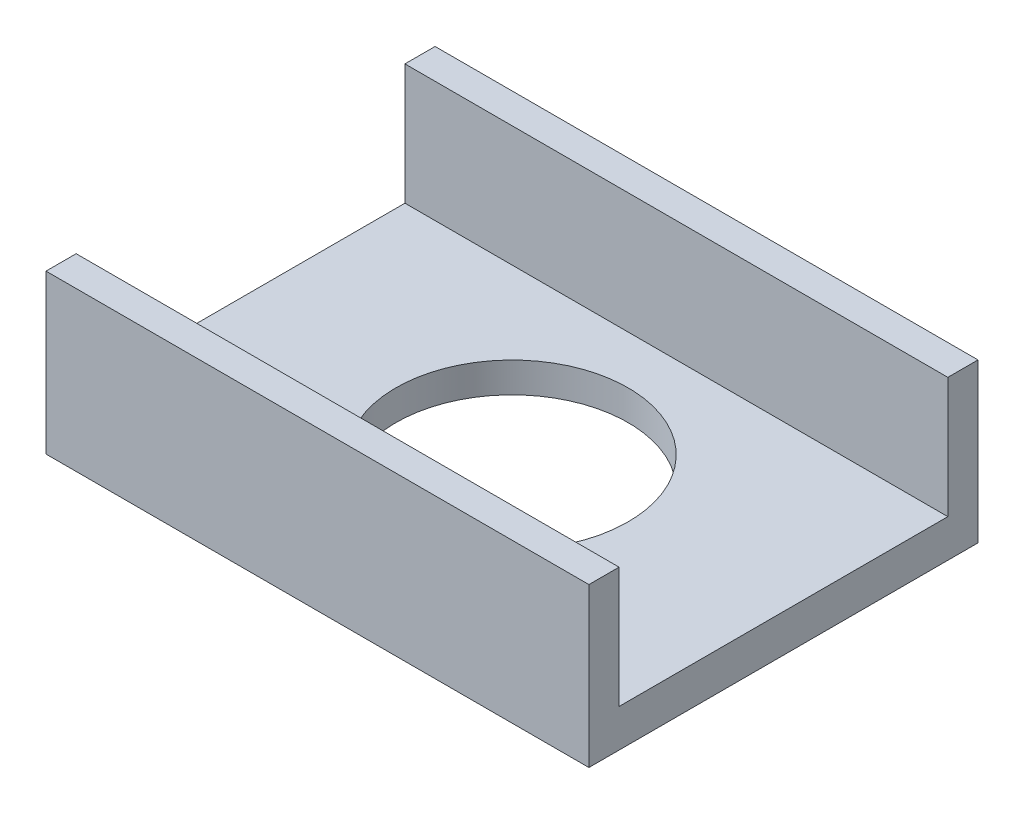
ISO-10303-21;
HEADER;
FILE_DESCRIPTION(('STEP AP214'),'2;1');
FILE_NAME('part.step','',(''),(''),'','','');
FILE_SCHEMA(('AUTOMOTIVE_DESIGN { 1 0 10303 214 1 1 1 1 }'));
ENDSEC;
DATA;
#1=APPLICATION_CONTEXT('core data for automotive mechanical design processes');
#2=APPLICATION_PROTOCOL_DEFINITION('international standard','automotive_design',2000,#1);
#3=PRODUCT_CONTEXT('',#1,'mechanical');
#4=PRODUCT('Part','Part','',(#3));
#5=PRODUCT_RELATED_PRODUCT_CATEGORY('part','',(#4));
#6=PRODUCT_DEFINITION_FORMATION('','',#4);
#7=PRODUCT_DEFINITION_CONTEXT('part definition',#1,'design');
#8=PRODUCT_DEFINITION('design','',#6,#7);
#9=PRODUCT_DEFINITION_SHAPE('','',#8);
#10=(LENGTH_UNIT() NAMED_UNIT(*) SI_UNIT(.MILLI.,.METRE.));
#11=(NAMED_UNIT(*) PLANE_ANGLE_UNIT() SI_UNIT($,.RADIAN.));
#12=(NAMED_UNIT(*) SI_UNIT($,.STERADIAN.) SOLID_ANGLE_UNIT());
#13=UNCERTAINTY_MEASURE_WITH_UNIT(LENGTH_MEASURE(1.E-05),#10,'distance_accuracy_value','');
#14=(GEOMETRIC_REPRESENTATION_CONTEXT(3) GLOBAL_UNCERTAINTY_ASSIGNED_CONTEXT((#13)) GLOBAL_UNIT_ASSIGNED_CONTEXT((#10,
#11,#12)) REPRESENTATION_CONTEXT('',''));
#15=CARTESIAN_POINT('',(0.,0.,0.));
#16=DIRECTION('',(0.,0.,1.));
#17=DIRECTION('',(1.,0.,0.));
#18=AXIS2_PLACEMENT_3D('',#15,#16,#17);
#19=CARTESIAN_POINT('',(0.,5.,0.));
#20=DIRECTION('',(0.,1.,0.));
#21=DIRECTION('',(0.,0.,1.));
#22=AXIS2_PLACEMENT_3D('',#19,#20,#21);
#23=PLANE('',#22);
#24=CARTESIAN_POINT('',(4.44089209850063E-13,5.,2.22044604925031E-13));
#25=DIRECTION('',(0.,1.,0.));
#26=DIRECTION('',(0.,0.,1.));
#27=AXIS2_PLACEMENT_3D('',#24,#25,#26);
#28=CIRCLE('',#27,19.25);
#29=CARTESIAN_POINT('',(4.44089209850063E-13,5.,19.2500000000002));
#30=VERTEX_POINT('',#29);
#31=EDGE_CURVE('E159',#30,#30,#28,.T.);
#32=ORIENTED_EDGE('',*,*,#31,.F.);
#33=EDGE_LOOP('',(#32));
#34=FACE_BOUND('',#33,.T.);
#35=DIRECTION('',(1.,0.,0.));
#36=VECTOR('',#35,1.);
#37=CARTESIAN_POINT('',(0.,5.,27.25));
#38=LINE('',#37,#36);
#39=CARTESIAN_POINT('',(-45.,5.,27.25));
#40=VERTEX_POINT('',#39);
#41=CARTESIAN_POINT('',(45.,5.,27.25));
#42=VERTEX_POINT('',#41);
#43=EDGE_CURVE('E58',#40,#42,#38,.T.);
#44=ORIENTED_EDGE('',*,*,#43,.T.);
#45=DIRECTION('',(0.,0.,1.));
#46=VECTOR('',#45,1.);
#47=CARTESIAN_POINT('',(45.,5.,0.));
#48=LINE('',#47,#46);
#49=CARTESIAN_POINT('',(45.,5.,-27.25));
#50=VERTEX_POINT('',#49);
#51=EDGE_CURVE('E225',#50,#42,#48,.T.);
#52=ORIENTED_EDGE('',*,*,#51,.F.);
#53=DIRECTION('',(-1.,0.,0.));
#54=VECTOR('',#53,1.);
#55=CARTESIAN_POINT('',(0.,5.,-27.25));
#56=LINE('',#55,#54);
#57=CARTESIAN_POINT('',(-45.,5.,-27.25));
#58=VERTEX_POINT('',#57);
#59=EDGE_CURVE('E139',#50,#58,#56,.T.);
#60=ORIENTED_EDGE('',*,*,#59,.T.);
#61=DIRECTION('',(0.,0.,1.));
#62=VECTOR('',#61,1.);
#63=CARTESIAN_POINT('',(-45.,5.,0.));
#64=LINE('',#63,#62);
#65=EDGE_CURVE('E63',#58,#40,#64,.T.);
#66=ORIENTED_EDGE('',*,*,#65,.T.);
#67=EDGE_LOOP('',(#44,#52,#60,#66));
#68=FACE_BOUND('',#67,.T.);
#69=ADVANCED_FACE('F41',(#34,#68),#23,.T.);
#70=CARTESIAN_POINT('',(0.,-1.27,0.));
#71=DIRECTION('',(0.,1.,0.));
#72=DIRECTION('',(0.,0.,1.));
#73=AXIS2_PLACEMENT_3D('',#70,#71,#72);
#74=PLANE('',#73);
#75=DIRECTION('',(0.,0.,1.));
#76=VECTOR('',#75,1.);
#77=CARTESIAN_POINT('',(45.,-1.27,0.));
#78=LINE('',#77,#76);
#79=CARTESIAN_POINT('',(45.,-1.27,-32.25));
#80=VERTEX_POINT('',#79);
#81=CARTESIAN_POINT('',(45.,-1.27,32.25));
#82=VERTEX_POINT('',#81);
#83=EDGE_CURVE('E246',#80,#82,#78,.T.);
#84=ORIENTED_EDGE('',*,*,#83,.T.);
#85=DIRECTION('',(1.,0.,0.));
#86=VECTOR('',#85,1.);
#87=CARTESIAN_POINT('',(0.,-1.27,32.25));
#88=LINE('',#87,#86);
#89=CARTESIAN_POINT('',(-45.,-1.27,32.25));
#90=VERTEX_POINT('',#89);
#91=EDGE_CURVE('E241',#90,#82,#88,.T.);
#92=ORIENTED_EDGE('',*,*,#91,.F.);
#93=DIRECTION('',(0.,0.,1.));
#94=VECTOR('',#93,1.);
#95=CARTESIAN_POINT('',(-45.,-1.27,0.));
#96=LINE('',#95,#94);
#97=CARTESIAN_POINT('',(-45.,-1.27,-32.25));
#98=VERTEX_POINT('',#97);
#99=EDGE_CURVE('E255',#98,#90,#96,.T.);
#100=ORIENTED_EDGE('',*,*,#99,.F.);
#101=DIRECTION('',(1.,0.,0.));
#102=VECTOR('',#101,1.);
#103=CARTESIAN_POINT('',(0.,-1.27,-32.25));
#104=LINE('',#103,#102);
#105=EDGE_CURVE('E251',#98,#80,#104,.T.);
#106=ORIENTED_EDGE('',*,*,#105,.T.);
#107=EDGE_LOOP('',(#84,#92,#100,#106));
#108=FACE_BOUND('',#107,.T.);
#109=DIRECTION('',(0.,0.,1.));
#110=VECTOR('',#109,1.);
#111=CARTESIAN_POINT('',(40.,-1.27,0.));
#112=LINE('',#111,#110);
#113=CARTESIAN_POINT('',(40.,-1.27,-27.25));
#114=VERTEX_POINT('',#113);
#115=CARTESIAN_POINT('',(40.,-1.27,27.25));
#116=VERTEX_POINT('',#115);
#117=EDGE_CURVE('E193',#114,#116,#112,.T.);
#118=ORIENTED_EDGE('',*,*,#117,.F.);
#119=DIRECTION('',(1.,0.,0.));
#120=VECTOR('',#119,1.);
#121=CARTESIAN_POINT('',(0.,-1.27,-27.25));
#122=LINE('',#121,#120);
#123=CARTESIAN_POINT('',(-40.,-1.27,-27.25));
#124=VERTEX_POINT('',#123);
#125=EDGE_CURVE('E196',#124,#114,#122,.T.);
#126=ORIENTED_EDGE('',*,*,#125,.F.);
#127=DIRECTION('',(0.,0.,1.));
#128=VECTOR('',#127,1.);
#129=CARTESIAN_POINT('',(-40.,-1.27,0.));
#130=LINE('',#129,#128);
#131=CARTESIAN_POINT('',(-40.,-1.27,27.25));
#132=VERTEX_POINT('',#131);
#133=EDGE_CURVE('E200',#124,#132,#130,.T.);
#134=ORIENTED_EDGE('',*,*,#133,.T.);
#135=DIRECTION('',(1.,0.,0.));
#136=VECTOR('',#135,1.);
#137=CARTESIAN_POINT('',(0.,-1.27,27.25));
#138=LINE('',#137,#136);
#139=EDGE_CURVE('E204',#132,#116,#138,.T.);
#140=ORIENTED_EDGE('',*,*,#139,.T.);
#141=EDGE_LOOP('',(#118,#126,#134,#140));
#142=FACE_BOUND('',#141,.T.);
#143=ADVANCED_FACE('F262',(#108,#142),#74,.F.);
#144=CARTESIAN_POINT('',(45.,-1.27,0.));
#145=DIRECTION('',(-1.,0.,0.));
#146=DIRECTION('',(0.,0.,1.));
#147=AXIS2_PLACEMENT_3D('',#144,#145,#146);
#148=PLANE('',#147);
#149=DIRECTION('',(0.,1.,0.));
#150=VECTOR('',#149,1.);
#151=CARTESIAN_POINT('',(45.,-1.27,-32.25));
#152=LINE('',#151,#150);
#153=CARTESIAN_POINT('',(45.,25.,-32.25));
#154=VERTEX_POINT('',#153);
#155=EDGE_CURVE('E237',#80,#154,#152,.T.);
#156=ORIENTED_EDGE('',*,*,#155,.T.);
#157=DIRECTION('',(0.,0.,-1.));
#158=VECTOR('',#157,1.);
#159=CARTESIAN_POINT('',(45.,25.,0.));
#160=LINE('',#159,#158);
#161=CARTESIAN_POINT('',(45.,25.,-27.25));
#162=VERTEX_POINT('',#161);
#163=EDGE_CURVE('E173',#162,#154,#160,.T.);
#164=ORIENTED_EDGE('',*,*,#163,.F.);
#165=DIRECTION('',(0.,-1.,0.));
#166=VECTOR('',#165,1.);
#167=CARTESIAN_POINT('',(45.,25.,-27.25));
#168=LINE('',#167,#166);
#169=EDGE_CURVE('E189',#162,#50,#168,.T.);
#170=ORIENTED_EDGE('',*,*,#169,.T.);
#171=ORIENTED_EDGE('',*,*,#51,.T.);
#172=DIRECTION('',(0.,-1.,0.));
#173=VECTOR('',#172,1.);
#174=CARTESIAN_POINT('',(45.,25.,27.25));
#175=LINE('',#174,#173);
#176=CARTESIAN_POINT('',(45.,25.,27.25));
#177=VERTEX_POINT('',#176);
#178=EDGE_CURVE('E140',#177,#42,#175,.T.);
#179=ORIENTED_EDGE('',*,*,#178,.F.);
#180=DIRECTION('',(0.,0.,-1.));
#181=VECTOR('',#180,1.);
#182=CARTESIAN_POINT('',(45.,25.,0.));
#183=LINE('',#182,#181);
#184=CARTESIAN_POINT('',(45.,25.,32.25));
#185=VERTEX_POINT('',#184);
#186=EDGE_CURVE('E154',#185,#177,#183,.T.);
#187=ORIENTED_EDGE('',*,*,#186,.F.);
#188=DIRECTION('',(0.,1.,0.));
#189=VECTOR('',#188,1.);
#190=CARTESIAN_POINT('',(45.,-1.27,32.25));
#191=LINE('',#190,#189);
#192=EDGE_CURVE('E11',#82,#185,#191,.T.);
#193=ORIENTED_EDGE('',*,*,#192,.F.);
#194=ORIENTED_EDGE('',*,*,#83,.F.);
#195=EDGE_LOOP('',(#156,#164,#170,#171,#179,#187,#193,#194));
#196=FACE_BOUND('',#195,.T.);
#197=ADVANCED_FACE('F272',(#196),#148,.F.);
#198=CARTESIAN_POINT('',(0.,-1.27,32.25));
#199=DIRECTION('',(0.,0.,1.));
#200=DIRECTION('',(1.,0.,0.));
#201=AXIS2_PLACEMENT_3D('',#198,#199,#200);
#202=PLANE('',#201);
#203=ORIENTED_EDGE('',*,*,#192,.T.);
#204=DIRECTION('',(1.,0.,0.));
#205=VECTOR('',#204,1.);
#206=CARTESIAN_POINT('',(0.,25.,32.25));
#207=LINE('',#206,#205);
#208=CARTESIAN_POINT('',(-45.,25.,32.25));
#209=VERTEX_POINT('',#208);
#210=EDGE_CURVE('E150',#209,#185,#207,.T.);
#211=ORIENTED_EDGE('',*,*,#210,.F.);
#212=DIRECTION('',(0.,1.,0.));
#213=VECTOR('',#212,1.);
#214=CARTESIAN_POINT('',(-45.,-1.27,32.25));
#215=LINE('',#214,#213);
#216=EDGE_CURVE('E50',#90,#209,#215,.T.);
#217=ORIENTED_EDGE('',*,*,#216,.F.);
#218=ORIENTED_EDGE('',*,*,#91,.T.);
#219=EDGE_LOOP('',(#203,#211,#217,#218));
#220=FACE_BOUND('',#219,.T.);
#221=ADVANCED_FACE('F274',(#220),#202,.T.);
#222=CARTESIAN_POINT('',(-45.,-1.27,0.));
#223=DIRECTION('',(-1.,0.,0.));
#224=DIRECTION('',(0.,0.,1.));
#225=AXIS2_PLACEMENT_3D('',#222,#223,#224);
#226=PLANE('',#225);
#227=ORIENTED_EDGE('',*,*,#65,.F.);
#228=DIRECTION('',(0.,-1.,0.));
#229=VECTOR('',#228,1.);
#230=CARTESIAN_POINT('',(-45.,25.,-27.25));
#231=LINE('',#230,#229);
#232=CARTESIAN_POINT('',(-45.,25.,-27.25));
#233=VERTEX_POINT('',#232);
#234=EDGE_CURVE('E184',#233,#58,#231,.T.);
#235=ORIENTED_EDGE('',*,*,#234,.F.);
#236=DIRECTION('',(0.,0.,1.));
#237=VECTOR('',#236,1.);
#238=CARTESIAN_POINT('',(-45.,25.,0.));
#239=LINE('',#238,#237);
#240=CARTESIAN_POINT('',(-45.,25.,-32.25));
#241=VERTEX_POINT('',#240);
#242=EDGE_CURVE('E181',#241,#233,#239,.T.);
#243=ORIENTED_EDGE('',*,*,#242,.F.);
#244=DIRECTION('',(0.,1.,0.));
#245=VECTOR('',#244,1.);
#246=CARTESIAN_POINT('',(-45.,-1.27,-32.25));
#247=LINE('',#246,#245);
#248=EDGE_CURVE('E240',#98,#241,#247,.T.);
#249=ORIENTED_EDGE('',*,*,#248,.F.);
#250=ORIENTED_EDGE('',*,*,#99,.T.);
#251=ORIENTED_EDGE('',*,*,#216,.T.);
#252=DIRECTION('',(0.,0.,1.));
#253=VECTOR('',#252,1.);
#254=CARTESIAN_POINT('',(-45.,25.,0.));
#255=LINE('',#254,#253);
#256=CARTESIAN_POINT('',(-45.,25.,27.25));
#257=VERTEX_POINT('',#256);
#258=EDGE_CURVE('E143',#257,#209,#255,.T.);
#259=ORIENTED_EDGE('',*,*,#258,.F.);
#260=DIRECTION('',(0.,-1.,0.));
#261=VECTOR('',#260,1.);
#262=CARTESIAN_POINT('',(-45.,25.,27.25));
#263=LINE('',#262,#261);
#264=EDGE_CURVE('E131',#257,#40,#263,.T.);
#265=ORIENTED_EDGE('',*,*,#264,.T.);
#266=EDGE_LOOP('',(#227,#235,#243,#249,#250,#251,#259,#265));
#267=FACE_BOUND('',#266,.T.);
#268=ADVANCED_FACE('F144',(#267),#226,.T.);
#269=CARTESIAN_POINT('',(0.,-1.27,-32.25));
#270=DIRECTION('',(0.,0.,1.));
#271=DIRECTION('',(1.,0.,0.));
#272=AXIS2_PLACEMENT_3D('',#269,#270,#271);
#273=PLANE('',#272);
#274=ORIENTED_EDGE('',*,*,#248,.T.);
#275=DIRECTION('',(-1.,0.,0.));
#276=VECTOR('',#275,1.);
#277=CARTESIAN_POINT('',(0.,25.,-32.25));
#278=LINE('',#277,#276);
#279=EDGE_CURVE('E177',#154,#241,#278,.T.);
#280=ORIENTED_EDGE('',*,*,#279,.F.);
#281=ORIENTED_EDGE('',*,*,#155,.F.);
#282=ORIENTED_EDGE('',*,*,#105,.F.);
#283=EDGE_LOOP('',(#274,#280,#281,#282));
#284=FACE_BOUND('',#283,.T.);
#285=ADVANCED_FACE('F269',(#284),#273,.F.);
#286=CARTESIAN_POINT('',(40.,-1.27,0.));
#287=DIRECTION('',(-1.,0.,0.));
#288=DIRECTION('',(0.,0.,1.));
#289=AXIS2_PLACEMENT_3D('',#286,#287,#288);
#290=PLANE('',#289);
#291=DIRECTION('',(0.,0.,1.));
#292=VECTOR('',#291,1.);
#293=CARTESIAN_POINT('',(40.,0.,0.));
#294=LINE('',#293,#292);
#295=CARTESIAN_POINT('',(40.,0.,-27.25));
#296=VERTEX_POINT('',#295);
#297=CARTESIAN_POINT('',(40.,0.,27.25));
#298=VERTEX_POINT('',#297);
#299=EDGE_CURVE('E192',#296,#298,#294,.T.);
#300=ORIENTED_EDGE('',*,*,#299,.F.);
#301=DIRECTION('',(0.,1.,0.));
#302=VECTOR('',#301,1.);
#303=CARTESIAN_POINT('',(40.,-1.27,-27.25));
#304=LINE('',#303,#302);
#305=EDGE_CURVE('E208',#114,#296,#304,.T.);
#306=ORIENTED_EDGE('',*,*,#305,.F.);
#307=ORIENTED_EDGE('',*,*,#117,.T.);
#308=DIRECTION('',(0.,1.,0.));
#309=VECTOR('',#308,1.);
#310=CARTESIAN_POINT('',(40.,-1.27,27.25));
#311=LINE('',#310,#309);
#312=EDGE_CURVE('E222',#116,#298,#311,.T.);
#313=ORIENTED_EDGE('',*,*,#312,.T.);
#314=EDGE_LOOP('',(#300,#306,#307,#313));
#315=FACE_BOUND('',#314,.T.);
#316=ADVANCED_FACE('F321',(#315),#290,.T.);
#317=CARTESIAN_POINT('',(0.,-1.27,27.25));
#318=DIRECTION('',(0.,0.,1.));
#319=DIRECTION('',(1.,0.,0.));
#320=AXIS2_PLACEMENT_3D('',#317,#318,#319);
#321=PLANE('',#320);
#322=DIRECTION('',(1.,0.,0.));
#323=VECTOR('',#322,1.);
#324=CARTESIAN_POINT('',(0.,0.,27.25));
#325=LINE('',#324,#323);
#326=CARTESIAN_POINT('',(-40.,0.,27.25));
#327=VERTEX_POINT('',#326);
#328=EDGE_CURVE('E197',#327,#298,#325,.T.);
#329=ORIENTED_EDGE('',*,*,#328,.T.);
#330=ORIENTED_EDGE('',*,*,#312,.F.);
#331=ORIENTED_EDGE('',*,*,#139,.F.);
#332=DIRECTION('',(0.,1.,0.));
#333=VECTOR('',#332,1.);
#334=CARTESIAN_POINT('',(-40.,-1.27,27.25));
#335=LINE('',#334,#333);
#336=EDGE_CURVE('E226',#132,#327,#335,.T.);
#337=ORIENTED_EDGE('',*,*,#336,.T.);
#338=EDGE_LOOP('',(#329,#330,#331,#337));
#339=FACE_BOUND('',#338,.T.);
#340=ADVANCED_FACE('F317',(#339),#321,.F.);
#341=CARTESIAN_POINT('',(-40.,-1.27,0.));
#342=DIRECTION('',(-1.,0.,0.));
#343=DIRECTION('',(0.,0.,1.));
#344=AXIS2_PLACEMENT_3D('',#341,#342,#343);
#345=PLANE('',#344);
#346=DIRECTION('',(0.,0.,1.));
#347=VECTOR('',#346,1.);
#348=CARTESIAN_POINT('',(-40.,0.,0.));
#349=LINE('',#348,#347);
#350=CARTESIAN_POINT('',(-40.,0.,-27.25));
#351=VERTEX_POINT('',#350);
#352=EDGE_CURVE('E215',#351,#327,#349,.T.);
#353=ORIENTED_EDGE('',*,*,#352,.T.);
#354=ORIENTED_EDGE('',*,*,#336,.F.);
#355=ORIENTED_EDGE('',*,*,#133,.F.);
#356=DIRECTION('',(0.,1.,0.));
#357=VECTOR('',#356,1.);
#358=CARTESIAN_POINT('',(-40.,-1.27,-27.25));
#359=LINE('',#358,#357);
#360=EDGE_CURVE('E229',#124,#351,#359,.T.);
#361=ORIENTED_EDGE('',*,*,#360,.T.);
#362=EDGE_LOOP('',(#353,#354,#355,#361));
#363=FACE_BOUND('',#362,.T.);
#364=ADVANCED_FACE('F320',(#363),#345,.F.);
#365=CARTESIAN_POINT('',(0.,-1.27,-27.25));
#366=DIRECTION('',(0.,0.,1.));
#367=DIRECTION('',(1.,0.,0.));
#368=AXIS2_PLACEMENT_3D('',#365,#366,#367);
#369=PLANE('',#368);
#370=DIRECTION('',(1.,0.,0.));
#371=VECTOR('',#370,1.);
#372=CARTESIAN_POINT('',(0.,0.,-27.25));
#373=LINE('',#372,#371);
#374=EDGE_CURVE('E212',#351,#296,#373,.T.);
#375=ORIENTED_EDGE('',*,*,#374,.F.);
#376=ORIENTED_EDGE('',*,*,#360,.F.);
#377=ORIENTED_EDGE('',*,*,#125,.T.);
#378=ORIENTED_EDGE('',*,*,#305,.T.);
#379=EDGE_LOOP('',(#375,#376,#377,#378));
#380=FACE_BOUND('',#379,.T.);
#381=ADVANCED_FACE('F316',(#380),#369,.T.);
#382=CARTESIAN_POINT('',(0.,0.,0.));
#383=DIRECTION('',(0.,1.,0.));
#384=DIRECTION('',(0.,0.,1.));
#385=AXIS2_PLACEMENT_3D('',#382,#383,#384);
#386=PLANE('',#385);
#387=CARTESIAN_POINT('',(4.44089209850063E-13,0.,2.22044604925031E-13));
#388=DIRECTION('',(0.,1.,0.));
#389=DIRECTION('',(0.,0.,1.));
#390=AXIS2_PLACEMENT_3D('',#387,#388,#389);
#391=CIRCLE('',#390,19.25);
#392=CARTESIAN_POINT('',(4.44089209850063E-13,0.,19.2500000000002));
#393=VERTEX_POINT('',#392);
#394=EDGE_CURVE('E44',#393,#393,#391,.T.);
#395=ORIENTED_EDGE('',*,*,#394,.T.);
#396=EDGE_LOOP('',(#395));
#397=FACE_BOUND('',#396,.T.);
#398=ORIENTED_EDGE('',*,*,#299,.T.);
#399=ORIENTED_EDGE('',*,*,#328,.F.);
#400=ORIENTED_EDGE('',*,*,#352,.F.);
#401=ORIENTED_EDGE('',*,*,#374,.T.);
#402=EDGE_LOOP('',(#398,#399,#400,#401));
#403=FACE_BOUND('',#402,.T.);
#404=ADVANCED_FACE('F297',(#397,#403),#386,.F.);
#405=CARTESIAN_POINT('',(0.,25.,-27.25));
#406=DIRECTION('',(0.,0.,1.));
#407=DIRECTION('',(1.,0.,0.));
#408=AXIS2_PLACEMENT_3D('',#405,#406,#407);
#409=PLANE('',#408);
#410=ORIENTED_EDGE('',*,*,#59,.F.);
#411=ORIENTED_EDGE('',*,*,#169,.F.);
#412=DIRECTION('',(-1.,0.,0.));
#413=VECTOR('',#412,1.);
#414=CARTESIAN_POINT('',(0.,25.,-27.25));
#415=LINE('',#414,#413);
#416=EDGE_CURVE('E169',#162,#233,#415,.T.);
#417=ORIENTED_EDGE('',*,*,#416,.T.);
#418=ORIENTED_EDGE('',*,*,#234,.T.);
#419=EDGE_LOOP('',(#410,#411,#417,#418));
#420=FACE_BOUND('',#419,.T.);
#421=ADVANCED_FACE('F282',(#420),#409,.T.);
#422=CARTESIAN_POINT('',(0.,25.,0.));
#423=DIRECTION('',(0.,1.,0.));
#424=DIRECTION('',(0.,0.,1.));
#425=AXIS2_PLACEMENT_3D('',#422,#423,#424);
#426=PLANE('',#425);
#427=ORIENTED_EDGE('',*,*,#416,.F.);
#428=ORIENTED_EDGE('',*,*,#163,.T.);
#429=ORIENTED_EDGE('',*,*,#279,.T.);
#430=ORIENTED_EDGE('',*,*,#242,.T.);
#431=EDGE_LOOP('',(#427,#428,#429,#430));
#432=FACE_BOUND('',#431,.T.);
#433=ADVANCED_FACE('F279',(#432),#426,.T.);
#434=CARTESIAN_POINT('',(0.,25.,27.25));
#435=DIRECTION('',(0.,0.,-1.));
#436=DIRECTION('',(-1.,0.,0.));
#437=AXIS2_PLACEMENT_3D('',#434,#435,#436);
#438=PLANE('',#437);
#439=ORIENTED_EDGE('',*,*,#43,.F.);
#440=ORIENTED_EDGE('',*,*,#264,.F.);
#441=DIRECTION('',(1.,0.,0.));
#442=VECTOR('',#441,1.);
#443=CARTESIAN_POINT('',(0.,25.,27.25));
#444=LINE('',#443,#442);
#445=EDGE_CURVE('E136',#257,#177,#444,.T.);
#446=ORIENTED_EDGE('',*,*,#445,.T.);
#447=ORIENTED_EDGE('',*,*,#178,.T.);
#448=EDGE_LOOP('',(#439,#440,#446,#447));
#449=FACE_BOUND('',#448,.T.);
#450=ADVANCED_FACE('F133',(#449),#438,.T.);
#451=CARTESIAN_POINT('',(0.,25.,0.));
#452=DIRECTION('',(0.,1.,0.));
#453=DIRECTION('',(0.,0.,1.));
#454=AXIS2_PLACEMENT_3D('',#451,#452,#453);
#455=PLANE('',#454);
#456=ORIENTED_EDGE('',*,*,#445,.F.);
#457=ORIENTED_EDGE('',*,*,#258,.T.);
#458=ORIENTED_EDGE('',*,*,#210,.T.);
#459=ORIENTED_EDGE('',*,*,#186,.T.);
#460=EDGE_LOOP('',(#456,#457,#458,#459));
#461=FACE_BOUND('',#460,.T.);
#462=ADVANCED_FACE('F152',(#461),#455,.T.);
#463=CARTESIAN_POINT('',(4.44089209850063E-13,-1.27,2.22044604925031E-13));
#464=DIRECTION('',(0.,1.,0.));
#465=DIRECTION('',(0.,0.,1.));
#466=AXIS2_PLACEMENT_3D('',#463,#464,#465);
#467=CYLINDRICAL_SURFACE('',#466,19.25);
#468=ORIENTED_EDGE('',*,*,#31,.T.);
#469=EDGE_LOOP('',(#468));
#470=FACE_BOUND('',#469,.T.);
#471=ORIENTED_EDGE('',*,*,#394,.F.);
#472=EDGE_LOOP('',(#471));
#473=FACE_BOUND('',#472,.T.);
#474=ADVANCED_FACE('F300',(#470,#473),#467,.F.);
#475=CLOSED_SHELL('',(#69,#143,#197,#221,#268,#285,#316,#340,#364,#381,#404,#421,#433,#450,#462,#474));
#476=MANIFOLD_SOLID_BREP('B2',#475);
#477=ADVANCED_BREP_SHAPE_REPRESENTATION('',(#18,#476),#14);
#478=SHAPE_DEFINITION_REPRESENTATION(#9,#477);
ENDSEC;
END-ISO-10303-21;
